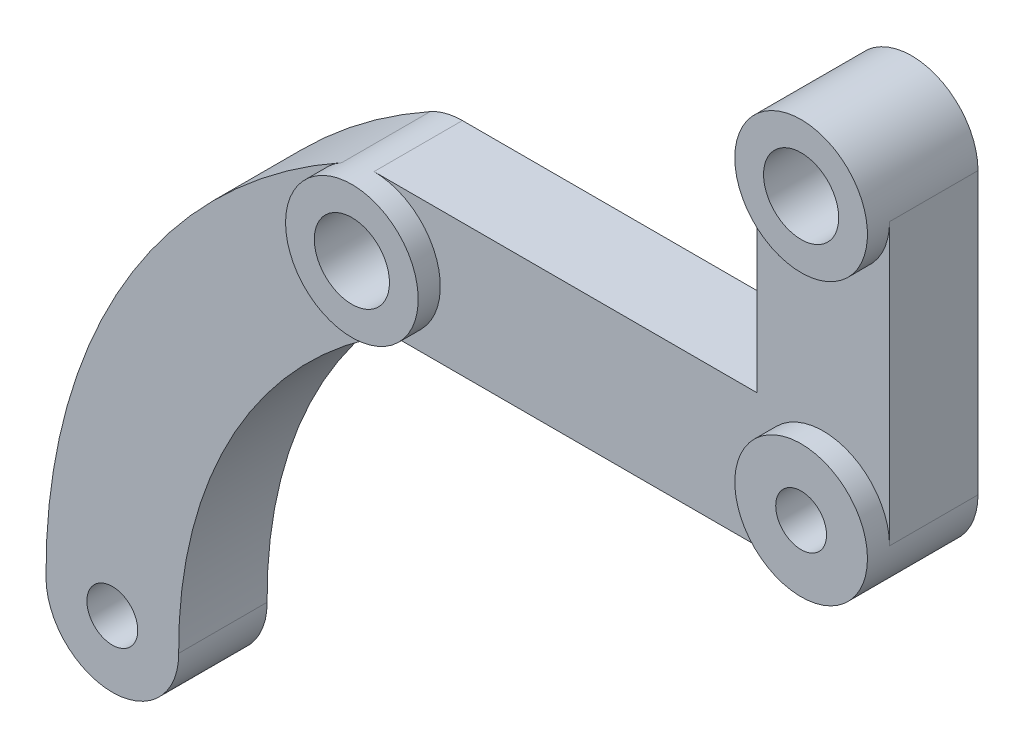
ISO-10303-21;
HEADER;
FILE_DESCRIPTION(('STEP AP214'),'2;1');
FILE_NAME('part.step','',(''),(''),'','','');
FILE_SCHEMA(('AUTOMOTIVE_DESIGN { 1 0 10303 214 1 1 1 1 }'));
ENDSEC;
DATA;
#1=APPLICATION_CONTEXT('core data for automotive mechanical design processes');
#2=APPLICATION_PROTOCOL_DEFINITION('international standard','automotive_design',2000,#1);
#3=PRODUCT_CONTEXT('',#1,'mechanical');
#4=PRODUCT('Part','Part','',(#3));
#5=PRODUCT_RELATED_PRODUCT_CATEGORY('part','',(#4));
#6=PRODUCT_DEFINITION_FORMATION('','',#4);
#7=PRODUCT_DEFINITION_CONTEXT('part definition',#1,'design');
#8=PRODUCT_DEFINITION('design','',#6,#7);
#9=PRODUCT_DEFINITION_SHAPE('','',#8);
#10=(LENGTH_UNIT() NAMED_UNIT(*) SI_UNIT(.MILLI.,.METRE.));
#11=(NAMED_UNIT(*) PLANE_ANGLE_UNIT() SI_UNIT($,.RADIAN.));
#12=(NAMED_UNIT(*) SI_UNIT($,.STERADIAN.) SOLID_ANGLE_UNIT());
#13=UNCERTAINTY_MEASURE_WITH_UNIT(LENGTH_MEASURE(1.E-05),#10,'distance_accuracy_value','');
#14=(GEOMETRIC_REPRESENTATION_CONTEXT(3) GLOBAL_UNCERTAINTY_ASSIGNED_CONTEXT((#13)) GLOBAL_UNIT_ASSIGNED_CONTEXT((#10,
#11,#12)) REPRESENTATION_CONTEXT('',''));
#15=CARTESIAN_POINT('',(0.,0.,0.));
#16=DIRECTION('',(0.,0.,1.));
#17=DIRECTION('',(1.,0.,0.));
#18=AXIS2_PLACEMENT_3D('',#15,#16,#17);
#19=CARTESIAN_POINT('',(-2.53999999999998,2.54000000000002,-5.));
#20=DIRECTION('',(0.,0.,1.));
#21=DIRECTION('',(-1.,0.,0.));
#22=AXIS2_PLACEMENT_3D('',#19,#20,#21);
#23=CYLINDRICAL_SURFACE('',#22,3.);
#24=CARTESIAN_POINT('',(-2.53999999999998,2.54000000000002,0.));
#25=DIRECTION('',(0.,0.,1.));
#26=DIRECTION('',(1.,0.,0.));
#27=AXIS2_PLACEMENT_3D('',#24,#25,#26);
#28=CIRCLE('',#27,3.);
#29=CARTESIAN_POINT('',(0.460000000000019,2.54000000000002,0.));
#30=VERTEX_POINT('',#29);
#31=EDGE_CURVE('E189',#30,#30,#28,.T.);
#32=ORIENTED_EDGE('',*,*,#31,.F.);
#33=EDGE_LOOP('',(#32));
#34=FACE_BOUND('',#33,.T.);
#35=CARTESIAN_POINT('',(-2.53999999999998,2.54000000000002,-5.));
#36=DIRECTION('',(0.,0.,1.));
#37=DIRECTION('',(1.,0.,0.));
#38=AXIS2_PLACEMENT_3D('',#35,#36,#37);
#39=CIRCLE('',#38,3.);
#40=CARTESIAN_POINT('',(-2.53999999999998,-0.459999999999989,-5.));
#41=VERTEX_POINT('',#40);
#42=CARTESIAN_POINT('',(0.460000000000041,2.54000000000002,-5.));
#43=VERTEX_POINT('',#42);
#44=EDGE_CURVE('E125',#41,#43,#39,.T.);
#45=ORIENTED_EDGE('',*,*,#44,.T.);
#46=DIRECTION('',(0.,0.,-1.));
#47=VECTOR('',#46,1.);
#48=CARTESIAN_POINT('',(0.460000000000041,2.54000000000002,14.0459958707099));
#49=LINE('',#48,#47);
#50=CARTESIAN_POINT('',(0.460000000000041,2.54000000000002,-1.00000000000001));
#51=VERTEX_POINT('',#50);
#52=EDGE_CURVE('E130',#51,#43,#49,.T.);
#53=ORIENTED_EDGE('',*,*,#52,.F.);
#54=CARTESIAN_POINT('',(-2.53999999999998,2.54000000000002,-1.00000000000001));
#55=DIRECTION('',(0.,0.,-1.));
#56=DIRECTION('',(-1.,0.,0.));
#57=AXIS2_PLACEMENT_3D('',#54,#55,#56);
#58=CIRCLE('',#57,3.);
#59=CARTESIAN_POINT('',(-2.53999999999998,-0.459999999999983,-1.00000000000001));
#60=VERTEX_POINT('',#59);
#61=EDGE_CURVE('E197',#60,#51,#58,.T.);
#62=ORIENTED_EDGE('',*,*,#61,.F.);
#63=DIRECTION('',(0.,0.,-1.));
#64=VECTOR('',#63,1.);
#65=CARTESIAN_POINT('',(-2.53999999999998,-0.459999999999983,20.1873169608612));
#66=LINE('',#65,#64);
#67=EDGE_CURVE('E143',#60,#41,#66,.T.);
#68=ORIENTED_EDGE('',*,*,#67,.T.);
#69=EDGE_LOOP('',(#45,#53,#62,#68));
#70=FACE_BOUND('',#69,.T.);
#71=ADVANCED_FACE('F39',(#34,#70),#23,.T.);
#72=CARTESIAN_POINT('',(-2.53999999999998,2.54000000000002,-5.00000000000013));
#73=DIRECTION('',(0.,0.,1.));
#74=DIRECTION('',(-1.,0.,0.));
#75=AXIS2_PLACEMENT_3D('',#72,#73,#74);
#76=CYLINDRICAL_SURFACE('',#75,1.15);
#77=CARTESIAN_POINT('',(-2.53999999999998,2.54000000000002,0.));
#78=DIRECTION('',(0.,0.,-1.));
#79=DIRECTION('',(-1.,0.,0.));
#80=AXIS2_PLACEMENT_3D('',#77,#78,#79);
#81=CIRCLE('',#80,1.15);
#82=CARTESIAN_POINT('',(-3.68999999999998,2.54000000000002,0.));
#83=VERTEX_POINT('',#82);
#84=EDGE_CURVE('E144',#83,#83,#81,.T.);
#85=ORIENTED_EDGE('',*,*,#84,.F.);
#86=EDGE_LOOP('',(#85));
#87=FACE_BOUND('',#86,.T.);
#88=CARTESIAN_POINT('',(-2.53999999999998,2.54000000000002,-5.));
#89=DIRECTION('',(0.,0.,1.));
#90=DIRECTION('',(1.,0.,0.));
#91=AXIS2_PLACEMENT_3D('',#88,#89,#90);
#92=CIRCLE('',#91,1.15);
#93=CARTESIAN_POINT('',(-1.38999999999998,2.54000000000002,-5.));
#94=VERTEX_POINT('',#93);
#95=EDGE_CURVE('E43',#94,#94,#92,.F.);
#96=ORIENTED_EDGE('',*,*,#95,.T.);
#97=EDGE_LOOP('',(#96));
#98=FACE_BOUND('',#97,.T.);
#99=ADVANCED_FACE('F268',(#87,#98),#76,.F.);
#100=CARTESIAN_POINT('',(-22.86,2.54000000000002,-5.));
#101=DIRECTION('',(0.,0.,1.));
#102=DIRECTION('',(-1.,0.,0.));
#103=AXIS2_PLACEMENT_3D('',#100,#101,#102);
#104=CYLINDRICAL_SURFACE('',#103,3.);
#105=DIRECTION('',(0.,0.,-1.));
#106=VECTOR('',#105,1.);
#107=CARTESIAN_POINT('',(-22.86,5.54000000000001,20.1873169608612));
#108=LINE('',#107,#106);
#109=CARTESIAN_POINT('',(-22.86,5.54000000000002,-1.00000000000005));
#110=VERTEX_POINT('',#109);
#111=CARTESIAN_POINT('',(-22.86,5.54000000000002,-5.));
#112=VERTEX_POINT('',#111);
#113=EDGE_CURVE('E174',#110,#112,#108,.T.);
#114=ORIENTED_EDGE('',*,*,#113,.T.);
#115=CARTESIAN_POINT('',(-22.86,2.54000000000002,-5.));
#116=DIRECTION('',(0.,0.,1.));
#117=DIRECTION('',(-1.,0.,0.));
#118=AXIS2_PLACEMENT_3D('',#115,#116,#117);
#119=CIRCLE('',#118,3.);
#120=CARTESIAN_POINT('',(-24.3161661411749,5.16289537902217,-5.));
#121=VERTEX_POINT('',#120);
#122=EDGE_CURVE('E224',#112,#121,#119,.T.);
#123=ORIENTED_EDGE('',*,*,#122,.T.);
#124=DIRECTION('',(0.,0.,1.));
#125=VECTOR('',#124,1.);
#126=CARTESIAN_POINT('',(-24.3161661411749,5.1628953790221,-35.6297382465745));
#127=LINE('',#126,#125);
#128=CARTESIAN_POINT('',(-24.316166141175,5.1628953790221,-1.00000000000009));
#129=VERTEX_POINT('',#128);
#130=EDGE_CURVE('E212',#121,#129,#127,.T.);
#131=ORIENTED_EDGE('',*,*,#130,.T.);
#132=CARTESIAN_POINT('',(-22.86,2.54000000000002,-1.00000000000008));
#133=DIRECTION('',(0.,0.,1.));
#134=DIRECTION('',(1.,0.,0.));
#135=AXIS2_PLACEMENT_3D('',#132,#133,#134);
#136=CIRCLE('',#135,3.);
#137=EDGE_CURVE('E48',#129,#110,#136,.T.);
#138=ORIENTED_EDGE('',*,*,#137,.T.);
#139=EDGE_LOOP('',(#114,#123,#131,#138));
#140=FACE_BOUND('',#139,.T.);
#141=CARTESIAN_POINT('',(-22.86,2.54000000000002,0.));
#142=DIRECTION('',(0.,0.,1.));
#143=DIRECTION('',(-1.,0.,0.));
#144=AXIS2_PLACEMENT_3D('',#141,#142,#143);
#145=CIRCLE('',#144,3.);
#146=CARTESIAN_POINT('',(-25.86,2.54000000000002,0.));
#147=VERTEX_POINT('',#146);
#148=EDGE_CURVE('E225',#147,#147,#145,.T.);
#149=ORIENTED_EDGE('',*,*,#148,.F.);
#150=EDGE_LOOP('',(#149));
#151=FACE_BOUND('',#150,.T.);
#152=ADVANCED_FACE('F231',(#140,#151),#104,.T.);
#153=CARTESIAN_POINT('',(-22.86,2.54000000000002,-5.));
#154=DIRECTION('',(0.,0.,1.));
#155=DIRECTION('',(-1.,0.,0.));
#156=AXIS2_PLACEMENT_3D('',#153,#154,#155);
#157=PLANE('',#156);
#158=CARTESIAN_POINT('',(-34.695141036091,-17.7744183979098,-5.00000000000012));
#159=DIRECTION('',(0.,0.,-1.));
#160=DIRECTION('',(-1.,0.,0.));
#161=AXIS2_PLACEMENT_3D('',#158,#159,#160);
#162=CIRCLE('',#161,1.1499999999809);
#163=CARTESIAN_POINT('',(-35.8451410360719,-17.7744183979098,-5.00000000000013));
#164=VERTEX_POINT('',#163);
#165=EDGE_CURVE('E151',#164,#164,#162,.T.);
#166=ORIENTED_EDGE('',*,*,#165,.F.);
#167=EDGE_LOOP('',(#166));
#168=FACE_BOUND('',#167,.T.);
#169=DIRECTION('',(1.,0.,0.));
#170=VECTOR('',#169,1.);
#171=CARTESIAN_POINT('',(-22.86,-0.459999999999981,-5.));
#172=LINE('',#171,#170);
#173=CARTESIAN_POINT('',(-22.0539914744158,-0.459999999999985,-5.));
#174=VERTEX_POINT('',#173);
#175=EDGE_CURVE('E160',#174,#41,#172,.T.);
#176=ORIENTED_EDGE('',*,*,#175,.F.);
#177=CARTESIAN_POINT('',(-11.6960595843257,-17.5688645725032,-5.));
#178=DIRECTION('',(0.,0.,1.));
#179=DIRECTION('',(1.,0.,0.));
#180=AXIS2_PLACEMENT_3D('',#177,#178,#179);
#181=CIRCLE('',#180,20.);
#182=CARTESIAN_POINT('',(-31.6952608467289,-17.7476070293785,-5.));
#183=VERTEX_POINT('',#182);
#184=EDGE_CURVE('E205',#174,#183,#181,.T.);
#185=ORIENTED_EDGE('',*,*,#184,.T.);
#186=CARTESIAN_POINT('',(-34.695141036091,-17.7744183979098,-5.));
#187=DIRECTION('',(0.,0.,1.));
#188=DIRECTION('',(1.,0.,0.));
#189=AXIS2_PLACEMENT_3D('',#186,#187,#188);
#190=CIRCLE('',#189,2.99999999999978);
#191=CARTESIAN_POINT('',(-37.6950212254513,-17.8012297664411,-5.));
#192=VERTEX_POINT('',#191);
#193=EDGE_CURVE('E214',#183,#192,#190,.F.);
#194=ORIENTED_EDGE('',*,*,#193,.T.);
#195=CARTESIAN_POINT('',(-11.6960595843257,-17.5688645725032,-5.));
#196=DIRECTION('',(0.,0.,1.));
#197=DIRECTION('',(1.,0.,0.));
#198=AXIS2_PLACEMENT_3D('',#195,#196,#197);
#199=CIRCLE('',#198,25.9999999999998);
#200=EDGE_CURVE('E210',#192,#121,#199,.F.);
#201=ORIENTED_EDGE('',*,*,#200,.T.);
#202=ORIENTED_EDGE('',*,*,#122,.F.);
#203=DIRECTION('',(-1.,0.,0.));
#204=VECTOR('',#203,1.);
#205=CARTESIAN_POINT('',(-22.86,5.54000000000001,-5.));
#206=LINE('',#205,#204);
#207=CARTESIAN_POINT('',(-5.53999999999996,5.54000000000002,-5.));
#208=VERTEX_POINT('',#207);
#209=EDGE_CURVE('E63',#208,#112,#206,.T.);
#210=ORIENTED_EDGE('',*,*,#209,.F.);
#211=DIRECTION('',(0.,-1.,0.));
#212=VECTOR('',#211,1.);
#213=CARTESIAN_POINT('',(-5.53999999999996,15.24,-5.));
#214=LINE('',#213,#212);
#215=CARTESIAN_POINT('',(-5.53999999999996,15.24,-5.));
#216=VERTEX_POINT('',#215);
#217=EDGE_CURVE('E131',#216,#208,#214,.T.);
#218=ORIENTED_EDGE('',*,*,#217,.F.);
#219=CARTESIAN_POINT('',(-2.53999999999998,15.24,-5.));
#220=DIRECTION('',(0.,0.,1.));
#221=DIRECTION('',(-1.,0.,0.));
#222=AXIS2_PLACEMENT_3D('',#219,#220,#221);
#223=CIRCLE('',#222,3.);
#224=CARTESIAN_POINT('',(0.460000000000038,15.24,-5.));
#225=VERTEX_POINT('',#224);
#226=EDGE_CURVE('E128',#225,#216,#223,.T.);
#227=ORIENTED_EDGE('',*,*,#226,.F.);
#228=DIRECTION('',(0.,1.,0.));
#229=VECTOR('',#228,1.);
#230=CARTESIAN_POINT('',(0.460000000000038,15.24,-5.));
#231=LINE('',#230,#229);
#232=EDGE_CURVE('E120',#43,#225,#231,.T.);
#233=ORIENTED_EDGE('',*,*,#232,.F.);
#234=ORIENTED_EDGE('',*,*,#44,.F.);
#235=EDGE_LOOP('',(#176,#185,#194,#201,#202,#210,#218,#227,#233,#234));
#236=FACE_BOUND('',#235,.T.);
#237=ORIENTED_EDGE('',*,*,#95,.F.);
#238=EDGE_LOOP('',(#237));
#239=FACE_BOUND('',#238,.T.);
#240=ADVANCED_FACE('F41',(#168,#236,#239),#157,.F.);
#241=CARTESIAN_POINT('',(-22.86,2.54000000000002,0.));
#242=DIRECTION('',(0.,0.,1.));
#243=DIRECTION('',(-1.,0.,0.));
#244=AXIS2_PLACEMENT_3D('',#241,#242,#243);
#245=PLANE('',#244);
#246=CARTESIAN_POINT('',(-22.86,2.54000000000002,0.));
#247=DIRECTION('',(0.,0.,-1.));
#248=DIRECTION('',(1.,0.,0.));
#249=AXIS2_PLACEMENT_3D('',#246,#247,#248);
#250=CIRCLE('',#249,1.7);
#251=CARTESIAN_POINT('',(-21.16,2.54000000000002,0.));
#252=VERTEX_POINT('',#251);
#253=EDGE_CURVE('E164',#252,#252,#250,.T.);
#254=ORIENTED_EDGE('',*,*,#253,.T.);
#255=EDGE_LOOP('',(#254));
#256=FACE_BOUND('',#255,.T.);
#257=ORIENTED_EDGE('',*,*,#148,.T.);
#258=EDGE_LOOP('',(#257));
#259=FACE_BOUND('',#258,.T.);
#260=ADVANCED_FACE('F283',(#256,#259),#245,.T.);
#261=CARTESIAN_POINT('',(-11.6960595843257,-17.5688645725032,-1.00000000000004));
#262=DIRECTION('',(0.,0.,-1.));
#263=DIRECTION('',(1.,0.,0.));
#264=AXIS2_PLACEMENT_3D('',#261,#262,#263);
#265=PLANE('',#264);
#266=CARTESIAN_POINT('',(-34.6951410360911,-17.7744183979098,-1.00000000000012));
#267=DIRECTION('',(0.,0.,-1.));
#268=DIRECTION('',(-1.,0.,0.));
#269=AXIS2_PLACEMENT_3D('',#266,#267,#268);
#270=CIRCLE('',#269,1.1499999999809);
#271=CARTESIAN_POINT('',(-35.845141036072,-17.7744183979098,-1.00000000000013));
#272=VERTEX_POINT('',#271);
#273=EDGE_CURVE('E147',#272,#272,#270,.T.);
#274=ORIENTED_EDGE('',*,*,#273,.T.);
#275=EDGE_LOOP('',(#274));
#276=FACE_BOUND('',#275,.T.);
#277=CARTESIAN_POINT('',(-11.6960595843257,-17.5688645725032,-1.00000000000004));
#278=DIRECTION('',(0.,0.,1.));
#279=DIRECTION('',(1.,0.,0.));
#280=AXIS2_PLACEMENT_3D('',#277,#278,#279);
#281=CIRCLE('',#280,20.);
#282=CARTESIAN_POINT('',(-22.0539914744158,-0.459999999999981,-1.00000000000008));
#283=VERTEX_POINT('',#282);
#284=CARTESIAN_POINT('',(-31.6952608467289,-17.7476070293785,-1.00000000000011));
#285=VERTEX_POINT('',#284);
#286=EDGE_CURVE('E206',#283,#285,#281,.T.);
#287=ORIENTED_EDGE('',*,*,#286,.F.);
#288=DIRECTION('',(1.,0.,0.));
#289=VECTOR('',#288,1.);
#290=CARTESIAN_POINT('',(-22.8599999999999,-0.459999999999981,-1.00000000000008));
#291=LINE('',#290,#289);
#292=EDGE_CURVE('E170',#283,#60,#291,.T.);
#293=ORIENTED_EDGE('',*,*,#292,.T.);
#294=ORIENTED_EDGE('',*,*,#61,.T.);
#295=DIRECTION('',(0.,1.,0.));
#296=VECTOR('',#295,1.);
#297=CARTESIAN_POINT('',(0.460000000000038,15.24,-0.999999999999999));
#298=LINE('',#297,#296);
#299=CARTESIAN_POINT('',(0.460000000000038,15.24,-0.999999999999999));
#300=VERTEX_POINT('',#299);
#301=EDGE_CURVE('E136',#51,#300,#298,.T.);
#302=ORIENTED_EDGE('',*,*,#301,.T.);
#303=CARTESIAN_POINT('',(-2.53999999999998,15.24,-1.00000000000001));
#304=DIRECTION('',(0.,0.,-1.));
#305=DIRECTION('',(-1.,0.,0.));
#306=AXIS2_PLACEMENT_3D('',#303,#304,#305);
#307=CIRCLE('',#306,3.);
#308=CARTESIAN_POINT('',(-5.53999999999996,15.24,-1.00000000000002));
#309=VERTEX_POINT('',#308);
#310=EDGE_CURVE('E181',#309,#300,#307,.F.);
#311=ORIENTED_EDGE('',*,*,#310,.F.);
#312=DIRECTION('',(0.,-1.,0.));
#313=VECTOR('',#312,1.);
#314=CARTESIAN_POINT('',(-5.53999999999996,15.24,-1.00000000000002));
#315=LINE('',#314,#313);
#316=CARTESIAN_POINT('',(-5.53999999999996,5.54000000000002,-1.00000000000002));
#317=VERTEX_POINT('',#316);
#318=EDGE_CURVE('E187',#309,#317,#315,.T.);
#319=ORIENTED_EDGE('',*,*,#318,.T.);
#320=DIRECTION('',(-1.,0.,0.));
#321=VECTOR('',#320,1.);
#322=CARTESIAN_POINT('',(-22.8599999999999,5.54000000000001,-1.00000000000008));
#323=LINE('',#322,#321);
#324=EDGE_CURVE('E55',#317,#110,#323,.T.);
#325=ORIENTED_EDGE('',*,*,#324,.T.);
#326=ORIENTED_EDGE('',*,*,#137,.F.);
#327=CARTESIAN_POINT('',(-11.6960595843257,-17.5688645725032,-1.00000000000004));
#328=DIRECTION('',(0.,0.,-1.));
#329=DIRECTION('',(1.,0.,0.));
#330=AXIS2_PLACEMENT_3D('',#327,#328,#329);
#331=CIRCLE('',#330,25.9999999999998);
#332=CARTESIAN_POINT('',(-37.6950212254513,-17.8012297664411,-1.00000000000013));
#333=VERTEX_POINT('',#332);
#334=EDGE_CURVE('E201',#333,#129,#331,.T.);
#335=ORIENTED_EDGE('',*,*,#334,.F.);
#336=CARTESIAN_POINT('',(-34.6951410360911,-17.7744183979098,-1.00000000000012));
#337=DIRECTION('',(0.,0.,-1.));
#338=DIRECTION('',(1.,0.,0.));
#339=AXIS2_PLACEMENT_3D('',#336,#337,#338);
#340=CIRCLE('',#339,2.99999999999978);
#341=EDGE_CURVE('E202',#285,#333,#340,.T.);
#342=ORIENTED_EDGE('',*,*,#341,.F.);
#343=EDGE_LOOP('',(#287,#293,#294,#302,#311,#319,#325,#326,#335,#342));
#344=FACE_BOUND('',#343,.T.);
#345=ADVANCED_FACE('F239',(#276,#344),#265,.F.);
#346=CARTESIAN_POINT('',(-11.6960595843256,-17.5688645725032,-35.6297382465745));
#347=DIRECTION('',(0.,0.,1.));
#348=DIRECTION('',(-1.,0.,0.));
#349=AXIS2_PLACEMENT_3D('',#346,#347,#348);
#350=CYLINDRICAL_SURFACE('',#349,20.);
#351=DIRECTION('',(0.,0.,1.));
#352=VECTOR('',#351,1.);
#353=CARTESIAN_POINT('',(-22.0539914744157,-0.45999999999998,-35.6297382465745));
#354=LINE('',#353,#352);
#355=EDGE_CURVE('E11',#174,#283,#354,.T.);
#356=ORIENTED_EDGE('',*,*,#355,.T.);
#357=ORIENTED_EDGE('',*,*,#286,.T.);
#358=DIRECTION('',(0.,0.,1.));
#359=VECTOR('',#358,1.);
#360=CARTESIAN_POINT('',(-31.6952608467288,-17.7476070293785,-35.6297382465746));
#361=LINE('',#360,#359);
#362=EDGE_CURVE('E217',#183,#285,#361,.T.);
#363=ORIENTED_EDGE('',*,*,#362,.F.);
#364=ORIENTED_EDGE('',*,*,#184,.F.);
#365=EDGE_LOOP('',(#356,#357,#363,#364));
#366=FACE_BOUND('',#365,.T.);
#367=ADVANCED_FACE('F249',(#366),#350,.F.);
#368=CARTESIAN_POINT('',(-34.6951410360909,-17.7744183979098,-35.6297382465746));
#369=DIRECTION('',(0.,0.,1.));
#370=DIRECTION('',(-1.,0.,0.));
#371=AXIS2_PLACEMENT_3D('',#368,#369,#370);
#372=CYLINDRICAL_SURFACE('',#371,2.99999999999978);
#373=ORIENTED_EDGE('',*,*,#362,.T.);
#374=ORIENTED_EDGE('',*,*,#341,.T.);
#375=DIRECTION('',(0.,0.,1.));
#376=VECTOR('',#375,1.);
#377=CARTESIAN_POINT('',(-37.6950212254512,-17.8012297664411,-35.6297382465746));
#378=LINE('',#377,#376);
#379=EDGE_CURVE('E213',#192,#333,#378,.T.);
#380=ORIENTED_EDGE('',*,*,#379,.F.);
#381=ORIENTED_EDGE('',*,*,#193,.F.);
#382=EDGE_LOOP('',(#373,#374,#380,#381));
#383=FACE_BOUND('',#382,.T.);
#384=ADVANCED_FACE('F287',(#383),#372,.T.);
#385=CARTESIAN_POINT('',(-11.6960595843256,-17.5688645725032,-35.6297382465745));
#386=DIRECTION('',(0.,0.,1.));
#387=DIRECTION('',(-1.,0.,0.));
#388=AXIS2_PLACEMENT_3D('',#385,#386,#387);
#389=CYLINDRICAL_SURFACE('',#388,25.9999999999998);
#390=ORIENTED_EDGE('',*,*,#379,.T.);
#391=ORIENTED_EDGE('',*,*,#334,.T.);
#392=ORIENTED_EDGE('',*,*,#130,.F.);
#393=ORIENTED_EDGE('',*,*,#200,.F.);
#394=EDGE_LOOP('',(#390,#391,#392,#393));
#395=FACE_BOUND('',#394,.T.);
#396=ADVANCED_FACE('F245',(#395),#389,.T.);
#397=CARTESIAN_POINT('',(-2.53999999999998,2.54000000000002,0.));
#398=DIRECTION('',(0.,0.,-1.));
#399=DIRECTION('',(1.,0.,0.));
#400=AXIS2_PLACEMENT_3D('',#397,#398,#399);
#401=PLANE('',#400);
#402=ORIENTED_EDGE('',*,*,#84,.T.);
#403=EDGE_LOOP('',(#402));
#404=FACE_BOUND('',#403,.T.);
#405=ORIENTED_EDGE('',*,*,#31,.T.);
#406=EDGE_LOOP('',(#405));
#407=FACE_BOUND('',#406,.T.);
#408=ADVANCED_FACE('F279',(#404,#407),#401,.F.);
#409=CARTESIAN_POINT('',(0.460000000000038,15.24,14.0459958707099));
#410=DIRECTION('',(1.,0.,0.));
#411=DIRECTION('',(0.,1.,0.));
#412=AXIS2_PLACEMENT_3D('',#409,#410,#411);
#413=PLANE('',#412);
#414=ORIENTED_EDGE('',*,*,#52,.T.);
#415=ORIENTED_EDGE('',*,*,#232,.T.);
#416=DIRECTION('',(0.,0.,-1.));
#417=VECTOR('',#416,1.);
#418=CARTESIAN_POINT('',(0.460000000000038,15.24,14.0459958707099));
#419=LINE('',#418,#417);
#420=EDGE_CURVE('E192',#300,#225,#419,.T.);
#421=ORIENTED_EDGE('',*,*,#420,.F.);
#422=ORIENTED_EDGE('',*,*,#301,.F.);
#423=EDGE_LOOP('',(#414,#415,#421,#422));
#424=FACE_BOUND('',#423,.T.);
#425=ADVANCED_FACE('F134',(#424),#413,.T.);
#426=CARTESIAN_POINT('',(-5.53999999999996,15.24,14.0459958707099));
#427=DIRECTION('',(-1.,0.,0.));
#428=DIRECTION('',(0.,-1.,0.));
#429=AXIS2_PLACEMENT_3D('',#426,#427,#428);
#430=PLANE('',#429);
#431=DIRECTION('',(0.,0.,1.));
#432=VECTOR('',#431,1.);
#433=CARTESIAN_POINT('',(-5.53999999999996,5.54000000000002,14.0459958707099));
#434=LINE('',#433,#432);
#435=EDGE_CURVE('E199',#208,#317,#434,.T.);
#436=ORIENTED_EDGE('',*,*,#435,.T.);
#437=ORIENTED_EDGE('',*,*,#318,.F.);
#438=DIRECTION('',(0.,0.,-1.));
#439=VECTOR('',#438,1.);
#440=CARTESIAN_POINT('',(-5.53999999999996,15.24,14.0459958707099));
#441=LINE('',#440,#439);
#442=EDGE_CURVE('E190',#309,#216,#441,.T.);
#443=ORIENTED_EDGE('',*,*,#442,.T.);
#444=ORIENTED_EDGE('',*,*,#217,.T.);
#445=EDGE_LOOP('',(#436,#437,#443,#444));
#446=FACE_BOUND('',#445,.T.);
#447=ADVANCED_FACE('F241',(#446),#430,.T.);
#448=CARTESIAN_POINT('',(-2.53999999999998,15.24,-5.));
#449=DIRECTION('',(0.,0.,1.));
#450=DIRECTION('',(-1.,0.,0.));
#451=AXIS2_PLACEMENT_3D('',#448,#449,#450);
#452=CYLINDRICAL_SURFACE('',#451,3.);
#453=ORIENTED_EDGE('',*,*,#420,.T.);
#454=ORIENTED_EDGE('',*,*,#226,.T.);
#455=ORIENTED_EDGE('',*,*,#442,.F.);
#456=ORIENTED_EDGE('',*,*,#310,.T.);
#457=EDGE_LOOP('',(#453,#454,#455,#456));
#458=FACE_BOUND('',#457,.T.);
#459=CARTESIAN_POINT('',(-2.53999999999998,15.24,0.));
#460=DIRECTION('',(0.,0.,1.));
#461=DIRECTION('',(-1.,0.,0.));
#462=AXIS2_PLACEMENT_3D('',#459,#460,#461);
#463=CIRCLE('',#462,3.);
#464=CARTESIAN_POINT('',(-5.53999999999998,15.24,0.));
#465=VERTEX_POINT('',#464);
#466=EDGE_CURVE('E178',#465,#465,#463,.T.);
#467=ORIENTED_EDGE('',*,*,#466,.F.);
#468=EDGE_LOOP('',(#467));
#469=FACE_BOUND('',#468,.T.);
#470=ADVANCED_FACE('F263',(#458,#469),#452,.T.);
#471=CARTESIAN_POINT('',(-2.53999999999998,15.24,0.));
#472=DIRECTION('',(0.,0.,1.));
#473=DIRECTION('',(-1.,0.,0.));
#474=AXIS2_PLACEMENT_3D('',#471,#472,#473);
#475=PLANE('',#474);
#476=CARTESIAN_POINT('',(-2.53999999999998,15.24,0.));
#477=DIRECTION('',(0.,0.,-1.));
#478=DIRECTION('',(-1.,0.,0.));
#479=AXIS2_PLACEMENT_3D('',#476,#477,#478);
#480=CIRCLE('',#479,1.7);
#481=CARTESIAN_POINT('',(-4.23999999999998,15.24,0.));
#482=VERTEX_POINT('',#481);
#483=EDGE_CURVE('E161',#482,#482,#480,.T.);
#484=ORIENTED_EDGE('',*,*,#483,.T.);
#485=EDGE_LOOP('',(#484));
#486=FACE_BOUND('',#485,.T.);
#487=ORIENTED_EDGE('',*,*,#466,.T.);
#488=EDGE_LOOP('',(#487));
#489=FACE_BOUND('',#488,.T.);
#490=ADVANCED_FACE('F255',(#486,#489),#475,.T.);
#491=CARTESIAN_POINT('',(-22.86,-0.459999999999981,20.1873169608612));
#492=DIRECTION('',(0.,-1.,0.));
#493=DIRECTION('',(1.,0.,0.));
#494=AXIS2_PLACEMENT_3D('',#491,#492,#493);
#495=PLANE('',#494);
#496=ORIENTED_EDGE('',*,*,#175,.T.);
#497=ORIENTED_EDGE('',*,*,#67,.F.);
#498=ORIENTED_EDGE('',*,*,#292,.F.);
#499=ORIENTED_EDGE('',*,*,#355,.F.);
#500=EDGE_LOOP('',(#496,#497,#498,#499));
#501=FACE_BOUND('',#500,.T.);
#502=ADVANCED_FACE('F253',(#501),#495,.T.);
#503=CARTESIAN_POINT('',(-22.86,5.54000000000001,20.1873169608612));
#504=DIRECTION('',(0.,1.,0.));
#505=DIRECTION('',(-1.,0.,0.));
#506=AXIS2_PLACEMENT_3D('',#503,#504,#505);
#507=PLANE('',#506);
#508=ORIENTED_EDGE('',*,*,#209,.T.);
#509=ORIENTED_EDGE('',*,*,#113,.F.);
#510=ORIENTED_EDGE('',*,*,#324,.F.);
#511=ORIENTED_EDGE('',*,*,#435,.F.);
#512=EDGE_LOOP('',(#508,#509,#510,#511));
#513=FACE_BOUND('',#512,.T.);
#514=ADVANCED_FACE('F235',(#513),#507,.T.);
#515=CARTESIAN_POINT('',(-2.53999999999998,15.24,-4.));
#516=DIRECTION('',(0.,0.,1.));
#517=DIRECTION('',(-1.,0.,0.));
#518=AXIS2_PLACEMENT_3D('',#515,#516,#517);
#519=CYLINDRICAL_SURFACE('',#518,1.7);
#520=CARTESIAN_POINT('',(-2.53999999999998,15.24,-4.));
#521=DIRECTION('',(0.,0.,-1.));
#522=DIRECTION('',(-1.,0.,0.));
#523=AXIS2_PLACEMENT_3D('',#520,#521,#522);
#524=CIRCLE('',#523,1.7);
#525=CARTESIAN_POINT('',(-4.23999999999998,15.24,-4.));
#526=VERTEX_POINT('',#525);
#527=EDGE_CURVE('E157',#526,#526,#524,.T.);
#528=ORIENTED_EDGE('',*,*,#527,.T.);
#529=EDGE_LOOP('',(#528));
#530=FACE_BOUND('',#529,.T.);
#531=ORIENTED_EDGE('',*,*,#483,.F.);
#532=EDGE_LOOP('',(#531));
#533=FACE_BOUND('',#532,.T.);
#534=ADVANCED_FACE('F261',(#530,#533),#519,.F.);
#535=CARTESIAN_POINT('',(-2.53999999999998,15.24,-4.));
#536=DIRECTION('',(0.,0.,1.));
#537=DIRECTION('',(-1.,0.,0.));
#538=AXIS2_PLACEMENT_3D('',#535,#536,#537);
#539=PLANE('',#538);
#540=ORIENTED_EDGE('',*,*,#527,.F.);
#541=EDGE_LOOP('',(#540));
#542=FACE_BOUND('',#541,.T.);
#543=ADVANCED_FACE('F306',(#542),#539,.T.);
#544=CARTESIAN_POINT('',(-22.86,2.54000000000002,-4.));
#545=DIRECTION('',(0.,0.,1.));
#546=DIRECTION('',(-1.,0.,0.));
#547=AXIS2_PLACEMENT_3D('',#544,#545,#546);
#548=CYLINDRICAL_SURFACE('',#547,1.7);
#549=CARTESIAN_POINT('',(-22.86,2.54000000000002,-4.));
#550=DIRECTION('',(0.,0.,-1.));
#551=DIRECTION('',(1.,0.,0.));
#552=AXIS2_PLACEMENT_3D('',#549,#550,#551);
#553=CIRCLE('',#552,1.7);
#554=CARTESIAN_POINT('',(-21.16,2.54000000000002,-4.));
#555=VERTEX_POINT('',#554);
#556=EDGE_CURVE('E154',#555,#555,#553,.T.);
#557=ORIENTED_EDGE('',*,*,#556,.T.);
#558=EDGE_LOOP('',(#557));
#559=FACE_BOUND('',#558,.T.);
#560=ORIENTED_EDGE('',*,*,#253,.F.);
#561=EDGE_LOOP('',(#560));
#562=FACE_BOUND('',#561,.T.);
#563=ADVANCED_FACE('F303',(#559,#562),#548,.F.);
#564=CARTESIAN_POINT('',(-22.86,2.54000000000002,-4.));
#565=DIRECTION('',(0.,0.,-1.));
#566=DIRECTION('',(1.,0.,0.));
#567=AXIS2_PLACEMENT_3D('',#564,#565,#566);
#568=PLANE('',#567);
#569=ORIENTED_EDGE('',*,*,#556,.F.);
#570=EDGE_LOOP('',(#569));
#571=FACE_BOUND('',#570,.T.);
#572=ADVANCED_FACE('F305',(#571),#568,.F.);
#573=CARTESIAN_POINT('',(-34.695141036091,-17.7744183979098,-5.00000000000012));
#574=DIRECTION('',(0.,0.,1.));
#575=DIRECTION('',(-1.,0.,0.));
#576=AXIS2_PLACEMENT_3D('',#573,#574,#575);
#577=CYLINDRICAL_SURFACE('',#576,1.1499999999809);
#578=ORIENTED_EDGE('',*,*,#165,.T.);
#579=EDGE_LOOP('',(#578));
#580=FACE_BOUND('',#579,.T.);
#581=ORIENTED_EDGE('',*,*,#273,.F.);
#582=EDGE_LOOP('',(#581));
#583=FACE_BOUND('',#582,.T.);
#584=ADVANCED_FACE('F313',(#580,#583),#577,.F.);
#585=CLOSED_SHELL('',(#71,#99,#152,#240,#260,#345,#367,#384,#396,#408,#425,#447,#470,#490,#502,
#514,#534,#543,#563,#572,#584));
#586=MANIFOLD_SOLID_BREP('B2',#585);
#587=ADVANCED_BREP_SHAPE_REPRESENTATION('',(#18,#586),#14);
#588=SHAPE_DEFINITION_REPRESENTATION(#9,#587);
ENDSEC;
END-ISO-10303-21;
